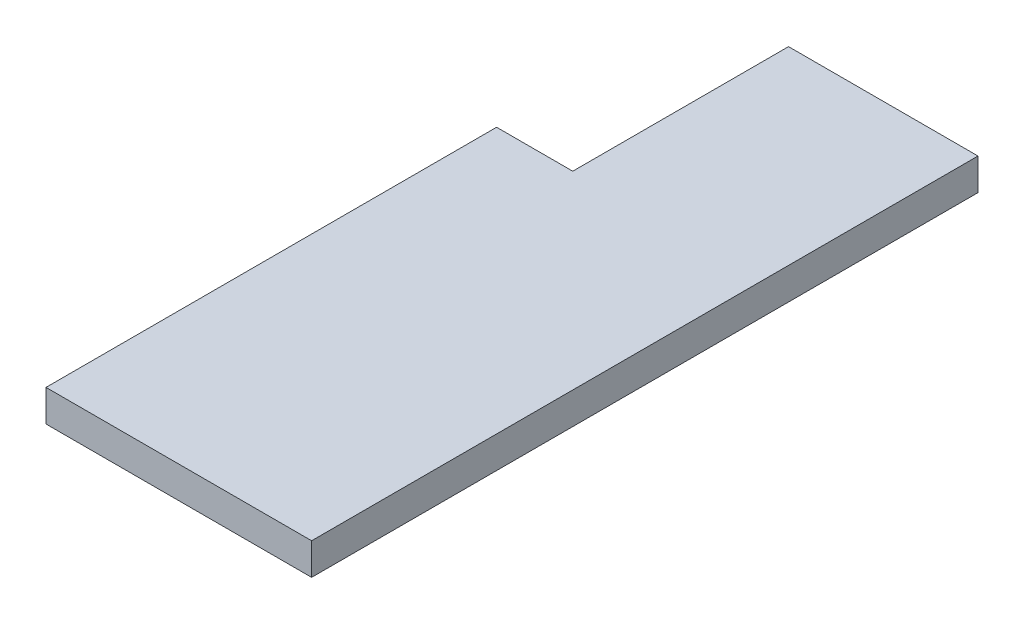
ISO-10303-21;
HEADER;
FILE_DESCRIPTION(('STEP AP214'),'2;1');
FILE_NAME('part.step','',(''),(''),'','','');
FILE_SCHEMA(('AUTOMOTIVE_DESIGN { 1 0 10303 214 1 1 1 1 }'));
ENDSEC;
DATA;
#1=APPLICATION_CONTEXT('core data for automotive mechanical design processes');
#2=APPLICATION_PROTOCOL_DEFINITION('international standard','automotive_design',2000,#1);
#3=PRODUCT_CONTEXT('',#1,'mechanical');
#4=PRODUCT('Part','Part','',(#3));
#5=PRODUCT_RELATED_PRODUCT_CATEGORY('part','',(#4));
#6=PRODUCT_DEFINITION_FORMATION('','',#4);
#7=PRODUCT_DEFINITION_CONTEXT('part definition',#1,'design');
#8=PRODUCT_DEFINITION('design','',#6,#7);
#9=PRODUCT_DEFINITION_SHAPE('','',#8);
#10=(LENGTH_UNIT() NAMED_UNIT(*) SI_UNIT(.MILLI.,.METRE.));
#11=(NAMED_UNIT(*) PLANE_ANGLE_UNIT() SI_UNIT($,.RADIAN.));
#12=(NAMED_UNIT(*) SI_UNIT($,.STERADIAN.) SOLID_ANGLE_UNIT());
#13=UNCERTAINTY_MEASURE_WITH_UNIT(LENGTH_MEASURE(1.E-05),#10,'distance_accuracy_value','');
#14=(GEOMETRIC_REPRESENTATION_CONTEXT(3) GLOBAL_UNCERTAINTY_ASSIGNED_CONTEXT((#13)) GLOBAL_UNIT_ASSIGNED_CONTEXT((#10,
#11,#12)) REPRESENTATION_CONTEXT('',''));
#15=CARTESIAN_POINT('',(0.,0.,0.));
#16=DIRECTION('',(0.,0.,1.));
#17=DIRECTION('',(1.,0.,0.));
#18=AXIS2_PLACEMENT_3D('',#15,#16,#17);
#19=CARTESIAN_POINT('',(0.,6.35,-82.55));
#20=DIRECTION('',(0.,0.,1.));
#21=DIRECTION('',(1.,0.,0.));
#22=AXIS2_PLACEMENT_3D('',#19,#20,#21);
#23=PLANE('',#22);
#24=DIRECTION('',(0.,1.,0.));
#25=VECTOR('',#24,1.);
#26=CARTESIAN_POINT('',(-37.846,6.35,-82.55));
#27=LINE('',#26,#25);
#28=CARTESIAN_POINT('',(-37.846,0.,-82.55));
#29=VERTEX_POINT('',#28);
#30=CARTESIAN_POINT('',(-37.846,6.35,-82.55));
#31=VERTEX_POINT('',#30);
#32=EDGE_CURVE('E49',#29,#31,#27,.T.);
#33=ORIENTED_EDGE('',*,*,#32,.F.);
#34=DIRECTION('',(-1.,0.,0.));
#35=VECTOR('',#34,1.);
#36=CARTESIAN_POINT('',(0.,0.,-82.55));
#37=LINE('',#36,#35);
#38=CARTESIAN_POINT('',(-53.086,0.,-82.55));
#39=VERTEX_POINT('',#38);
#40=EDGE_CURVE('E38',#29,#39,#37,.T.);
#41=ORIENTED_EDGE('',*,*,#40,.T.);
#42=DIRECTION('',(0.,1.,0.));
#43=VECTOR('',#42,1.);
#44=CARTESIAN_POINT('',(-53.086,-0.00100000000000013,-82.55));
#45=LINE('',#44,#43);
#46=CARTESIAN_POINT('',(-53.086,6.35,-82.55));
#47=VERTEX_POINT('',#46);
#48=EDGE_CURVE('E128',#39,#47,#45,.T.);
#49=ORIENTED_EDGE('',*,*,#48,.T.);
#50=DIRECTION('',(-1.,0.,0.));
#51=VECTOR('',#50,1.);
#52=CARTESIAN_POINT('',(0.,6.35,-82.55));
#53=LINE('',#52,#51);
#54=EDGE_CURVE('E11',#31,#47,#53,.T.);
#55=ORIENTED_EDGE('',*,*,#54,.F.);
#56=EDGE_LOOP('',(#33,#41,#49,#55));
#57=FACE_BOUND('',#56,.T.);
#58=ADVANCED_FACE('F35',(#57),#23,.F.);
#59=CARTESIAN_POINT('',(0.,6.35,0.));
#60=DIRECTION('',(0.,1.,0.));
#61=DIRECTION('',(0.,0.,1.));
#62=AXIS2_PLACEMENT_3D('',#59,#60,#61);
#63=PLANE('',#62);
#64=DIRECTION('',(0.,0.,1.));
#65=VECTOR('',#64,1.);
#66=CARTESIAN_POINT('',(0.0671648173723588,6.35,-136.08112580642));
#67=LINE('',#66,#65);
#68=CARTESIAN_POINT('',(0.0671648173723589,6.35,-125.73));
#69=VERTEX_POINT('',#68);
#70=CARTESIAN_POINT('',(0.0671648173723588,6.35,7.62));
#71=VERTEX_POINT('',#70);
#72=EDGE_CURVE('E107',#69,#71,#67,.T.);
#73=ORIENTED_EDGE('',*,*,#72,.F.);
#74=DIRECTION('',(1.,0.,0.));
#75=VECTOR('',#74,1.);
#76=CARTESIAN_POINT('',(-0.508000000000021,6.35,-125.73));
#77=LINE('',#76,#75);
#78=CARTESIAN_POINT('',(-37.846,6.35,-125.73));
#79=VERTEX_POINT('',#78);
#80=EDGE_CURVE('E111',#79,#69,#77,.T.);
#81=ORIENTED_EDGE('',*,*,#80,.F.);
#82=DIRECTION('',(0.,0.,1.));
#83=VECTOR('',#82,1.);
#84=CARTESIAN_POINT('',(-37.846,6.35,-125.73));
#85=LINE('',#84,#83);
#86=EDGE_CURVE('E119',#79,#31,#85,.T.);
#87=ORIENTED_EDGE('',*,*,#86,.T.);
#88=ORIENTED_EDGE('',*,*,#54,.T.);
#89=DIRECTION('',(0.,0.,1.));
#90=VECTOR('',#89,1.);
#91=CARTESIAN_POINT('',(-53.086,6.35,7.62));
#92=LINE('',#91,#90);
#93=CARTESIAN_POINT('',(-53.086,6.35,7.62));
#94=VERTEX_POINT('',#93);
#95=EDGE_CURVE('E124',#47,#94,#92,.T.);
#96=ORIENTED_EDGE('',*,*,#95,.T.);
#97=DIRECTION('',(-1.,0.,0.));
#98=VECTOR('',#97,1.);
#99=CARTESIAN_POINT('',(0.,6.35,7.62));
#100=LINE('',#99,#98);
#101=EDGE_CURVE('E133',#71,#94,#100,.T.);
#102=ORIENTED_EDGE('',*,*,#101,.F.);
#103=EDGE_LOOP('',(#73,#81,#87,#88,#96,#102));
#104=FACE_BOUND('',#103,.T.);
#105=ADVANCED_FACE('F141',(#104),#63,.T.);
#106=CARTESIAN_POINT('',(0.,0.,0.));
#107=DIRECTION('',(0.,1.,0.));
#108=DIRECTION('',(0.,0.,1.));
#109=AXIS2_PLACEMENT_3D('',#106,#107,#108);
#110=PLANE('',#109);
#111=DIRECTION('',(-1.,0.,0.));
#112=VECTOR('',#111,1.);
#113=CARTESIAN_POINT('',(-0.508000000000021,0.,-125.73));
#114=LINE('',#113,#112);
#115=CARTESIAN_POINT('',(0.0671648173723468,0.,-125.73));
#116=VERTEX_POINT('',#115);
#117=CARTESIAN_POINT('',(-37.846,0.,-125.73));
#118=VERTEX_POINT('',#117);
#119=EDGE_CURVE('E87',#116,#118,#114,.T.);
#120=ORIENTED_EDGE('',*,*,#119,.F.);
#121=DIRECTION('',(0.,0.,1.));
#122=VECTOR('',#121,1.);
#123=CARTESIAN_POINT('',(0.0671648173723588,0.,-136.08112580642));
#124=LINE('',#123,#122);
#125=CARTESIAN_POINT('',(0.0671648173723588,0.,7.62));
#126=VERTEX_POINT('',#125);
#127=EDGE_CURVE('E91',#116,#126,#124,.T.);
#128=ORIENTED_EDGE('',*,*,#127,.T.);
#129=DIRECTION('',(1.,0.,0.));
#130=VECTOR('',#129,1.);
#131=CARTESIAN_POINT('',(0.,0.,7.62));
#132=LINE('',#131,#130);
#133=CARTESIAN_POINT('',(-53.086,0.,7.62));
#134=VERTEX_POINT('',#133);
#135=EDGE_CURVE('E136',#134,#126,#132,.T.);
#136=ORIENTED_EDGE('',*,*,#135,.F.);
#137=DIRECTION('',(0.,0.,-1.));
#138=VECTOR('',#137,1.);
#139=CARTESIAN_POINT('',(-53.086,0.,7.62));
#140=LINE('',#139,#138);
#141=EDGE_CURVE('E57',#134,#39,#140,.T.);
#142=ORIENTED_EDGE('',*,*,#141,.T.);
#143=ORIENTED_EDGE('',*,*,#40,.F.);
#144=DIRECTION('',(0.,0.,1.));
#145=VECTOR('',#144,1.);
#146=CARTESIAN_POINT('',(-37.846,0.,-125.73));
#147=LINE('',#146,#145);
#148=EDGE_CURVE('E94',#118,#29,#147,.T.);
#149=ORIENTED_EDGE('',*,*,#148,.F.);
#150=EDGE_LOOP('',(#120,#128,#136,#142,#143,#149));
#151=FACE_BOUND('',#150,.T.);
#152=ADVANCED_FACE('F89',(#151),#110,.F.);
#153=CARTESIAN_POINT('',(0.,0.,7.62));
#154=DIRECTION('',(0.,0.,-1.));
#155=DIRECTION('',(-1.,0.,0.));
#156=AXIS2_PLACEMENT_3D('',#153,#154,#155);
#157=PLANE('',#156);
#158=DIRECTION('',(0.,1.,0.));
#159=VECTOR('',#158,1.);
#160=CARTESIAN_POINT('',(-53.086,-0.00100000000000013,7.62));
#161=LINE('',#160,#159);
#162=EDGE_CURVE('E127',#134,#94,#161,.T.);
#163=ORIENTED_EDGE('',*,*,#162,.F.);
#164=ORIENTED_EDGE('',*,*,#135,.T.);
#165=DIRECTION('',(0.,1.,0.));
#166=VECTOR('',#165,1.);
#167=CARTESIAN_POINT('',(0.0671648173723588,0.,7.62));
#168=LINE('',#167,#166);
#169=EDGE_CURVE('E106',#126,#71,#168,.T.);
#170=ORIENTED_EDGE('',*,*,#169,.T.);
#171=ORIENTED_EDGE('',*,*,#101,.T.);
#172=EDGE_LOOP('',(#163,#164,#170,#171));
#173=FACE_BOUND('',#172,.T.);
#174=ADVANCED_FACE('F142',(#173),#157,.F.);
#175=CARTESIAN_POINT('',(-53.086,-0.00100000000000013,7.62));
#176=DIRECTION('',(-1.,0.,0.));
#177=DIRECTION('',(0.,0.,1.));
#178=AXIS2_PLACEMENT_3D('',#175,#176,#177);
#179=PLANE('',#178);
#180=ORIENTED_EDGE('',*,*,#162,.T.);
#181=ORIENTED_EDGE('',*,*,#95,.F.);
#182=ORIENTED_EDGE('',*,*,#48,.F.);
#183=ORIENTED_EDGE('',*,*,#141,.F.);
#184=EDGE_LOOP('',(#180,#181,#182,#183));
#185=FACE_BOUND('',#184,.T.);
#186=ADVANCED_FACE('F139',(#185),#179,.T.);
#187=CARTESIAN_POINT('',(-37.846,6.35,-125.73));
#188=DIRECTION('',(1.,0.,0.));
#189=DIRECTION('',(0.,0.,-1.));
#190=AXIS2_PLACEMENT_3D('',#187,#188,#189);
#191=PLANE('',#190);
#192=ORIENTED_EDGE('',*,*,#32,.T.);
#193=ORIENTED_EDGE('',*,*,#86,.F.);
#194=DIRECTION('',(0.,1.,0.));
#195=VECTOR('',#194,1.);
#196=CARTESIAN_POINT('',(-37.846,6.35,-125.73));
#197=LINE('',#196,#195);
#198=EDGE_CURVE('E98',#118,#79,#197,.T.);
#199=ORIENTED_EDGE('',*,*,#198,.F.);
#200=ORIENTED_EDGE('',*,*,#148,.T.);
#201=EDGE_LOOP('',(#192,#193,#199,#200));
#202=FACE_BOUND('',#201,.T.);
#203=ADVANCED_FACE('F149',(#202),#191,.F.);
#204=CARTESIAN_POINT('',(0.,0.,-125.73));
#205=DIRECTION('',(0.,0.,-1.));
#206=DIRECTION('',(-1.,0.,0.));
#207=AXIS2_PLACEMENT_3D('',#204,#205,#206);
#208=PLANE('',#207);
#209=ORIENTED_EDGE('',*,*,#80,.T.);
#210=DIRECTION('',(0.,-1.,0.));
#211=VECTOR('',#210,1.);
#212=CARTESIAN_POINT('',(0.0671648173723477,6.35,-125.73));
#213=LINE('',#212,#211);
#214=EDGE_CURVE('E104',#69,#116,#213,.T.);
#215=ORIENTED_EDGE('',*,*,#214,.T.);
#216=ORIENTED_EDGE('',*,*,#119,.T.);
#217=ORIENTED_EDGE('',*,*,#198,.T.);
#218=EDGE_LOOP('',(#209,#215,#216,#217));
#219=FACE_BOUND('',#218,.T.);
#220=ADVANCED_FACE('F109',(#219),#208,.T.);
#221=CARTESIAN_POINT('',(0.0671648173723588,0.,-136.08112580642));
#222=DIRECTION('',(1.,0.,0.));
#223=DIRECTION('',(0.,0.,-1.));
#224=AXIS2_PLACEMENT_3D('',#221,#222,#223);
#225=PLANE('',#224);
#226=ORIENTED_EDGE('',*,*,#127,.F.);
#227=ORIENTED_EDGE('',*,*,#214,.F.);
#228=ORIENTED_EDGE('',*,*,#72,.T.);
#229=ORIENTED_EDGE('',*,*,#169,.F.);
#230=EDGE_LOOP('',(#226,#227,#228,#229));
#231=FACE_BOUND('',#230,.T.);
#232=ADVANCED_FACE('F102',(#231),#225,.T.);
#233=CLOSED_SHELL('',(#58,#105,#152,#174,#186,#203,#220,#232));
#234=MANIFOLD_SOLID_BREP('B2',#233);
#235=ADVANCED_BREP_SHAPE_REPRESENTATION('',(#18,#234),#14);
#236=SHAPE_DEFINITION_REPRESENTATION(#9,#235);
ENDSEC;
END-ISO-10303-21;
